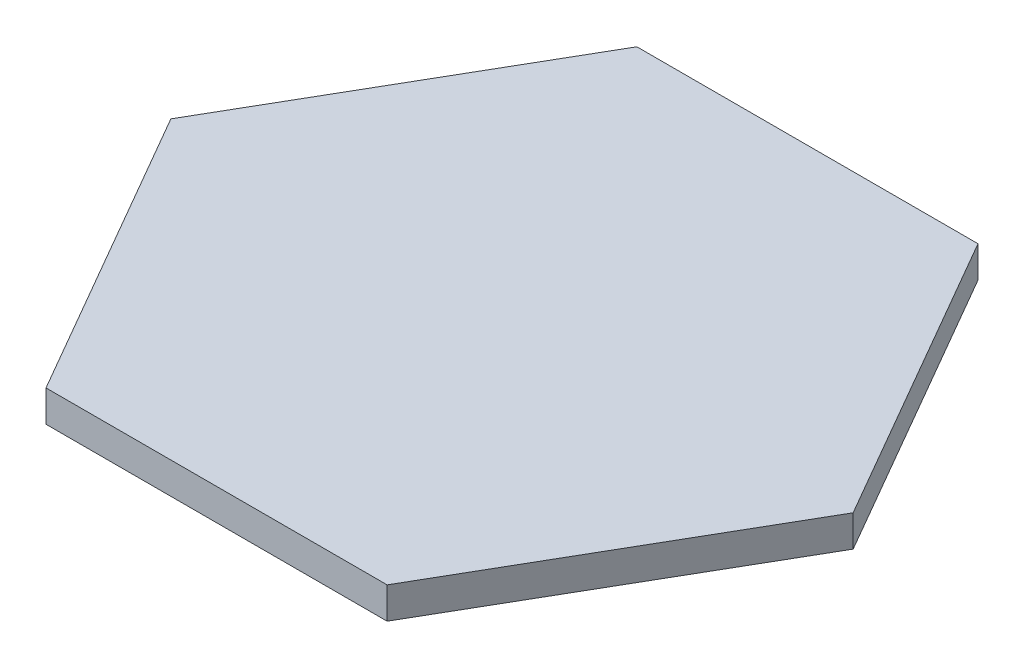
ISO-10303-21;
HEADER;
FILE_DESCRIPTION(('STEP AP214'),'2;1');
FILE_NAME('part.step','',(''),(''),'','','');
FILE_SCHEMA(('AUTOMOTIVE_DESIGN { 1 0 10303 214 1 1 1 1 }'));
ENDSEC;
DATA;
#1=APPLICATION_CONTEXT('core data for automotive mechanical design processes');
#2=APPLICATION_PROTOCOL_DEFINITION('international standard','automotive_design',2000,#1);
#3=PRODUCT_CONTEXT('',#1,'mechanical');
#4=PRODUCT('Part','Part','',(#3));
#5=PRODUCT_RELATED_PRODUCT_CATEGORY('part','',(#4));
#6=PRODUCT_DEFINITION_FORMATION('','',#4);
#7=PRODUCT_DEFINITION_CONTEXT('part definition',#1,'design');
#8=PRODUCT_DEFINITION('design','',#6,#7);
#9=PRODUCT_DEFINITION_SHAPE('','',#8);
#10=(LENGTH_UNIT() NAMED_UNIT(*) SI_UNIT(.MILLI.,.METRE.));
#11=(NAMED_UNIT(*) PLANE_ANGLE_UNIT() SI_UNIT($,.RADIAN.));
#12=(NAMED_UNIT(*) SI_UNIT($,.STERADIAN.) SOLID_ANGLE_UNIT());
#13=UNCERTAINTY_MEASURE_WITH_UNIT(LENGTH_MEASURE(1.E-05),#10,'distance_accuracy_value','');
#14=(GEOMETRIC_REPRESENTATION_CONTEXT(3) GLOBAL_UNCERTAINTY_ASSIGNED_CONTEXT((#13)) GLOBAL_UNIT_ASSIGNED_CONTEXT((#10,
#11,#12)) REPRESENTATION_CONTEXT('',''));
#15=CARTESIAN_POINT('',(0.,0.,0.));
#16=DIRECTION('',(0.,0.,1.));
#17=DIRECTION('',(1.,0.,0.));
#18=AXIS2_PLACEMENT_3D('',#15,#16,#17);
#19=CARTESIAN_POINT('',(-16.25,3.,-28.1458256229943));
#20=DIRECTION('',(0.866025403784439,0.,0.5));
#21=DIRECTION('',(0.5,0.,-0.866025403784439));
#22=AXIS2_PLACEMENT_3D('',#19,#20,#21);
#23=PLANE('',#22);
#24=DIRECTION('',(-0.5,0.,0.866025403784439));
#25=VECTOR('',#24,1.);
#26=CARTESIAN_POINT('',(-16.25,0.,-28.1458256229943));
#27=LINE('',#26,#25);
#28=CARTESIAN_POINT('',(-16.25,0.,-28.1458256229943));
#29=VERTEX_POINT('',#28);
#30=CARTESIAN_POINT('',(-32.5,0.,0.));
#31=VERTEX_POINT('',#30);
#32=EDGE_CURVE('E130',#29,#31,#27,.T.);
#33=ORIENTED_EDGE('',*,*,#32,.T.);
#34=DIRECTION('',(0.,-1.,0.));
#35=VECTOR('',#34,1.);
#36=CARTESIAN_POINT('',(-32.5,3.,0.));
#37=LINE('',#36,#35);
#38=CARTESIAN_POINT('',(-32.5,3.,0.));
#39=VERTEX_POINT('',#38);
#40=EDGE_CURVE('E11',#39,#31,#37,.T.);
#41=ORIENTED_EDGE('',*,*,#40,.F.);
#42=DIRECTION('',(-0.5,0.,0.866025403784439));
#43=VECTOR('',#42,1.);
#44=CARTESIAN_POINT('',(-16.25,3.,-28.1458256229943));
#45=LINE('',#44,#43);
#46=CARTESIAN_POINT('',(-16.25,3.,-28.1458256229943));
#47=VERTEX_POINT('',#46);
#48=EDGE_CURVE('E146',#47,#39,#45,.T.);
#49=ORIENTED_EDGE('',*,*,#48,.F.);
#50=DIRECTION('',(0.,-1.,0.));
#51=VECTOR('',#50,1.);
#52=CARTESIAN_POINT('',(-16.25,3.,-28.1458256229943));
#53=LINE('',#52,#51);
#54=EDGE_CURVE('E126',#47,#29,#53,.T.);
#55=ORIENTED_EDGE('',*,*,#54,.T.);
#56=EDGE_LOOP('',(#33,#41,#49,#55));
#57=FACE_BOUND('',#56,.T.);
#58=ADVANCED_FACE('F41',(#57),#23,.F.);
#59=CARTESIAN_POINT('',(-32.5,3.,0.));
#60=DIRECTION('',(0.866025403784439,0.,-0.5));
#61=DIRECTION('',(-0.5,0.,-0.866025403784439));
#62=AXIS2_PLACEMENT_3D('',#59,#60,#61);
#63=PLANE('',#62);
#64=DIRECTION('',(0.5,0.,0.866025403784439));
#65=VECTOR('',#64,1.);
#66=CARTESIAN_POINT('',(-32.5,0.,0.));
#67=LINE('',#66,#65);
#68=CARTESIAN_POINT('',(-16.25,0.,28.1458256229943));
#69=VERTEX_POINT('',#68);
#70=EDGE_CURVE('E134',#31,#69,#67,.T.);
#71=ORIENTED_EDGE('',*,*,#70,.T.);
#72=DIRECTION('',(0.,-1.,0.));
#73=VECTOR('',#72,1.);
#74=CARTESIAN_POINT('',(-16.25,3.,28.1458256229943));
#75=LINE('',#74,#73);
#76=CARTESIAN_POINT('',(-16.25,3.,28.1458256229943));
#77=VERTEX_POINT('',#76);
#78=EDGE_CURVE('E50',#77,#69,#75,.T.);
#79=ORIENTED_EDGE('',*,*,#78,.F.);
#80=DIRECTION('',(0.5,0.,0.866025403784439));
#81=VECTOR('',#80,1.);
#82=CARTESIAN_POINT('',(-32.5,3.,0.));
#83=LINE('',#82,#81);
#84=EDGE_CURVE('E95',#39,#77,#83,.T.);
#85=ORIENTED_EDGE('',*,*,#84,.F.);
#86=ORIENTED_EDGE('',*,*,#40,.T.);
#87=EDGE_LOOP('',(#71,#79,#85,#86));
#88=FACE_BOUND('',#87,.T.);
#89=ADVANCED_FACE('F174',(#88),#63,.F.);
#90=CARTESIAN_POINT('',(-16.25,3.,28.1458256229943));
#91=DIRECTION('',(0.,0.,-1.));
#92=DIRECTION('',(-1.,0.,0.));
#93=AXIS2_PLACEMENT_3D('',#90,#91,#92);
#94=PLANE('',#93);
#95=DIRECTION('',(1.,0.,0.));
#96=VECTOR('',#95,1.);
#97=CARTESIAN_POINT('',(-16.25,0.,28.1458256229943));
#98=LINE('',#97,#96);
#99=CARTESIAN_POINT('',(16.25,0.,28.1458256229943));
#100=VERTEX_POINT('',#99);
#101=EDGE_CURVE('E137',#69,#100,#98,.T.);
#102=ORIENTED_EDGE('',*,*,#101,.T.);
#103=DIRECTION('',(0.,-1.,0.));
#104=VECTOR('',#103,1.);
#105=CARTESIAN_POINT('',(16.25,3.,28.1458256229943));
#106=LINE('',#105,#104);
#107=CARTESIAN_POINT('',(16.25,3.,28.1458256229943));
#108=VERTEX_POINT('',#107);
#109=EDGE_CURVE('E119',#108,#100,#106,.T.);
#110=ORIENTED_EDGE('',*,*,#109,.F.);
#111=DIRECTION('',(1.,0.,0.));
#112=VECTOR('',#111,1.);
#113=CARTESIAN_POINT('',(-16.25,3.,28.1458256229943));
#114=LINE('',#113,#112);
#115=EDGE_CURVE('E108',#77,#108,#114,.T.);
#116=ORIENTED_EDGE('',*,*,#115,.F.);
#117=ORIENTED_EDGE('',*,*,#78,.T.);
#118=EDGE_LOOP('',(#102,#110,#116,#117));
#119=FACE_BOUND('',#118,.T.);
#120=ADVANCED_FACE('F156',(#119),#94,.F.);
#121=CARTESIAN_POINT('',(16.25,3.,28.1458256229943));
#122=DIRECTION('',(-0.866025403784439,0.,-0.5));
#123=DIRECTION('',(-0.5,0.,0.866025403784439));
#124=AXIS2_PLACEMENT_3D('',#121,#122,#123);
#125=PLANE('',#124);
#126=DIRECTION('',(0.499999999999999,0.,-0.866025403784439));
#127=VECTOR('',#126,1.);
#128=CARTESIAN_POINT('',(16.25,0.,28.1458256229943));
#129=LINE('',#128,#127);
#130=CARTESIAN_POINT('',(32.5,0.,0.));
#131=VERTEX_POINT('',#130);
#132=EDGE_CURVE('E117',#100,#131,#129,.T.);
#133=ORIENTED_EDGE('',*,*,#132,.T.);
#134=DIRECTION('',(0.,-1.,0.));
#135=VECTOR('',#134,1.);
#136=CARTESIAN_POINT('',(32.5,3.,0.));
#137=LINE('',#136,#135);
#138=CARTESIAN_POINT('',(32.5,3.,0.));
#139=VERTEX_POINT('',#138);
#140=EDGE_CURVE('E114',#139,#131,#137,.T.);
#141=ORIENTED_EDGE('',*,*,#140,.F.);
#142=DIRECTION('',(0.499999999999999,0.,-0.866025403784439));
#143=VECTOR('',#142,1.);
#144=CARTESIAN_POINT('',(16.25,3.,28.1458256229943));
#145=LINE('',#144,#143);
#146=EDGE_CURVE('E102',#108,#139,#145,.T.);
#147=ORIENTED_EDGE('',*,*,#146,.F.);
#148=ORIENTED_EDGE('',*,*,#109,.T.);
#149=EDGE_LOOP('',(#133,#141,#147,#148));
#150=FACE_BOUND('',#149,.T.);
#151=ADVANCED_FACE('F115',(#150),#125,.F.);
#152=CARTESIAN_POINT('',(32.5,3.,0.));
#153=DIRECTION('',(-0.866025403784439,0.,0.5));
#154=DIRECTION('',(0.5,0.,0.866025403784439));
#155=AXIS2_PLACEMENT_3D('',#152,#153,#154);
#156=PLANE('',#155);
#157=DIRECTION('',(-0.5,0.,-0.866025403784439));
#158=VECTOR('',#157,1.);
#159=CARTESIAN_POINT('',(32.5,0.,0.));
#160=LINE('',#159,#158);
#161=CARTESIAN_POINT('',(16.25,0.,-28.1458256229943));
#162=VERTEX_POINT('',#161);
#163=EDGE_CURVE('E81',#131,#162,#160,.T.);
#164=ORIENTED_EDGE('',*,*,#163,.T.);
#165=DIRECTION('',(0.,-1.,0.));
#166=VECTOR('',#165,1.);
#167=CARTESIAN_POINT('',(16.25,3.,-28.1458256229943));
#168=LINE('',#167,#166);
#169=CARTESIAN_POINT('',(16.25,3.,-28.1458256229943));
#170=VERTEX_POINT('',#169);
#171=EDGE_CURVE('E120',#170,#162,#168,.T.);
#172=ORIENTED_EDGE('',*,*,#171,.F.);
#173=DIRECTION('',(-0.5,0.,-0.866025403784439));
#174=VECTOR('',#173,1.);
#175=CARTESIAN_POINT('',(32.5,3.,0.));
#176=LINE('',#175,#174);
#177=EDGE_CURVE('E106',#139,#170,#176,.T.);
#178=ORIENTED_EDGE('',*,*,#177,.F.);
#179=ORIENTED_EDGE('',*,*,#140,.T.);
#180=EDGE_LOOP('',(#164,#172,#178,#179));
#181=FACE_BOUND('',#180,.T.);
#182=ADVANCED_FACE('F122',(#181),#156,.F.);
#183=CARTESIAN_POINT('',(16.25,3.,-28.1458256229943));
#184=DIRECTION('',(0.,0.,1.));
#185=DIRECTION('',(1.,0.,0.));
#186=AXIS2_PLACEMENT_3D('',#183,#184,#185);
#187=PLANE('',#186);
#188=DIRECTION('',(-1.,0.,0.));
#189=VECTOR('',#188,1.);
#190=CARTESIAN_POINT('',(16.25,0.,-28.1458256229943));
#191=LINE('',#190,#189);
#192=EDGE_CURVE('E87',#162,#29,#191,.T.);
#193=ORIENTED_EDGE('',*,*,#192,.T.);
#194=ORIENTED_EDGE('',*,*,#54,.F.);
#195=DIRECTION('',(-1.,0.,0.));
#196=VECTOR('',#195,1.);
#197=CARTESIAN_POINT('',(16.25,3.,-28.1458256229943));
#198=LINE('',#197,#196);
#199=EDGE_CURVE('E58',#170,#47,#198,.T.);
#200=ORIENTED_EDGE('',*,*,#199,.F.);
#201=ORIENTED_EDGE('',*,*,#171,.T.);
#202=EDGE_LOOP('',(#193,#194,#200,#201));
#203=FACE_BOUND('',#202,.T.);
#204=ADVANCED_FACE('F163',(#203),#187,.F.);
#205=CARTESIAN_POINT('',(0.,3.,0.));
#206=DIRECTION('',(0.,1.,0.));
#207=DIRECTION('',(0.,0.,1.));
#208=AXIS2_PLACEMENT_3D('',#205,#206,#207);
#209=PLANE('',#208);
#210=ORIENTED_EDGE('',*,*,#48,.T.);
#211=ORIENTED_EDGE('',*,*,#84,.T.);
#212=ORIENTED_EDGE('',*,*,#115,.T.);
#213=ORIENTED_EDGE('',*,*,#146,.T.);
#214=ORIENTED_EDGE('',*,*,#177,.T.);
#215=ORIENTED_EDGE('',*,*,#199,.T.);
#216=EDGE_LOOP('',(#210,#211,#212,#213,#214,#215));
#217=FACE_BOUND('',#216,.T.);
#218=ADVANCED_FACE('F104',(#217),#209,.T.);
#219=CARTESIAN_POINT('',(0.,0.,0.));
#220=DIRECTION('',(0.,1.,0.));
#221=DIRECTION('',(0.,0.,1.));
#222=AXIS2_PLACEMENT_3D('',#219,#220,#221);
#223=PLANE('',#222);
#224=ORIENTED_EDGE('',*,*,#32,.F.);
#225=ORIENTED_EDGE('',*,*,#192,.F.);
#226=ORIENTED_EDGE('',*,*,#163,.F.);
#227=ORIENTED_EDGE('',*,*,#132,.F.);
#228=ORIENTED_EDGE('',*,*,#101,.F.);
#229=ORIENTED_EDGE('',*,*,#70,.F.);
#230=EDGE_LOOP('',(#224,#225,#226,#227,#228,#229));
#231=FACE_BOUND('',#230,.T.);
#232=ADVANCED_FACE('F159',(#231),#223,.F.);
#233=CLOSED_SHELL('',(#58,#89,#120,#151,#182,#204,#218,#232));
#234=MANIFOLD_SOLID_BREP('B2',#233);
#235=ADVANCED_BREP_SHAPE_REPRESENTATION('',(#18,#234),#14);
#236=SHAPE_DEFINITION_REPRESENTATION(#9,#235);
ENDSEC;
END-ISO-10303-21;
